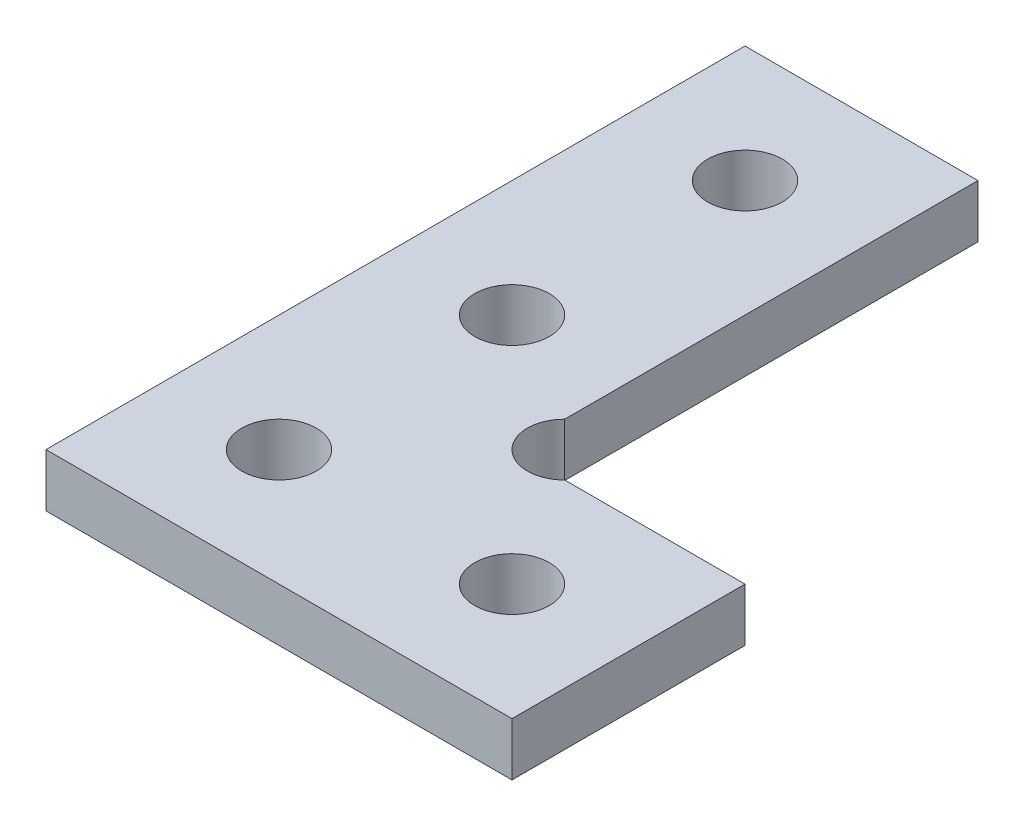
ISO-10303-21;
HEADER;
FILE_DESCRIPTION(('STEP AP214'),'2;1');
FILE_NAME('part.step','',(''),(''),'','','');
FILE_SCHEMA(('AUTOMOTIVE_DESIGN { 1 0 10303 214 1 1 1 1 }'));
ENDSEC;
DATA;
#1=APPLICATION_CONTEXT('core data for automotive mechanical design processes');
#2=APPLICATION_PROTOCOL_DEFINITION('international standard','automotive_design',2000,#1);
#3=PRODUCT_CONTEXT('',#1,'mechanical');
#4=PRODUCT('Part','Part','',(#3));
#5=PRODUCT_RELATED_PRODUCT_CATEGORY('part','',(#4));
#6=PRODUCT_DEFINITION_FORMATION('','',#4);
#7=PRODUCT_DEFINITION_CONTEXT('part definition',#1,'design');
#8=PRODUCT_DEFINITION('design','',#6,#7);
#9=PRODUCT_DEFINITION_SHAPE('','',#8);
#10=(LENGTH_UNIT() NAMED_UNIT(*) SI_UNIT(.MILLI.,.METRE.));
#11=(NAMED_UNIT(*) PLANE_ANGLE_UNIT() SI_UNIT($,.RADIAN.));
#12=(NAMED_UNIT(*) SI_UNIT($,.STERADIAN.) SOLID_ANGLE_UNIT());
#13=UNCERTAINTY_MEASURE_WITH_UNIT(LENGTH_MEASURE(1.E-05),#10,'distance_accuracy_value','');
#14=(GEOMETRIC_REPRESENTATION_CONTEXT(3) GLOBAL_UNCERTAINTY_ASSIGNED_CONTEXT((#13)) GLOBAL_UNIT_ASSIGNED_CONTEXT((#10,
#11,#12)) REPRESENTATION_CONTEXT('',''));
#15=CARTESIAN_POINT('',(0.,0.,0.));
#16=DIRECTION('',(0.,0.,1.));
#17=DIRECTION('',(1.,0.,0.));
#18=AXIS2_PLACEMENT_3D('',#15,#16,#17);
#19=CARTESIAN_POINT('',(10.,-1.13999999999986,-29.9999999999998));
#20=DIRECTION('',(0.,0.,-1.));
#21=DIRECTION('',(-1.,0.,0.));
#22=AXIS2_PLACEMENT_3D('',#19,#20,#21);
#23=PLANE('',#22);
#24=DIRECTION('',(-1.,0.,0.));
#25=VECTOR('',#24,1.);
#26=CARTESIAN_POINT('',(10.,1.14000000000014,-29.9999999999998));
#27=LINE('',#26,#25);
#28=CARTESIAN_POINT('',(10.,1.14000000000014,-29.9999999999998));
#29=VERTEX_POINT('',#28);
#30=CARTESIAN_POINT('',(0.,1.14000000000014,-29.9999999999998));
#31=VERTEX_POINT('',#30);
#32=EDGE_CURVE('E123',#29,#31,#27,.T.);
#33=ORIENTED_EDGE('',*,*,#32,.F.);
#34=DIRECTION('',(0.,1.,0.));
#35=VECTOR('',#34,1.);
#36=CARTESIAN_POINT('',(10.,-1.13999999999986,-29.9999999999998));
#37=LINE('',#36,#35);
#38=CARTESIAN_POINT('',(10.,-1.13999999999986,-29.9999999999998));
#39=VERTEX_POINT('',#38);
#40=EDGE_CURVE('E11',#39,#29,#37,.T.);
#41=ORIENTED_EDGE('',*,*,#40,.F.);
#42=DIRECTION('',(-1.,0.,0.));
#43=VECTOR('',#42,1.);
#44=CARTESIAN_POINT('',(10.,-1.13999999999986,-29.9999999999998));
#45=LINE('',#44,#43);
#46=CARTESIAN_POINT('',(0.,-1.13999999999986,-29.9999999999998));
#47=VERTEX_POINT('',#46);
#48=EDGE_CURVE('E141',#39,#47,#45,.T.);
#49=ORIENTED_EDGE('',*,*,#48,.T.);
#50=DIRECTION('',(0.,1.,0.));
#51=VECTOR('',#50,1.);
#52=CARTESIAN_POINT('',(0.,-1.13999999999986,-29.9999999999998));
#53=LINE('',#52,#51);
#54=EDGE_CURVE('E35',#47,#31,#53,.T.);
#55=ORIENTED_EDGE('',*,*,#54,.T.);
#56=EDGE_LOOP('',(#33,#41,#49,#55));
#57=FACE_BOUND('',#56,.T.);
#58=ADVANCED_FACE('F32',(#57),#23,.T.);
#59=CARTESIAN_POINT('',(10.,-1.13999999999986,-12.2627400407862));
#60=DIRECTION('',(1.,0.,0.));
#61=DIRECTION('',(0.,0.,-1.));
#62=AXIS2_PLACEMENT_3D('',#59,#60,#61);
#63=PLANE('',#62);
#64=DIRECTION('',(0.,0.,-1.));
#65=VECTOR('',#64,1.);
#66=CARTESIAN_POINT('',(10.,1.14000000000014,-12.2627400407862));
#67=LINE('',#66,#65);
#68=CARTESIAN_POINT('',(10.,1.14000000000014,-12.2627400407862));
#69=VERTEX_POINT('',#68);
#70=EDGE_CURVE('E139',#69,#29,#67,.T.);
#71=ORIENTED_EDGE('',*,*,#70,.F.);
#72=DIRECTION('',(0.,1.,0.));
#73=VECTOR('',#72,1.);
#74=CARTESIAN_POINT('',(10.,-1.13999999999986,-12.2627400407862));
#75=LINE('',#74,#73);
#76=CARTESIAN_POINT('',(10.,-1.13999999999986,-12.2627400407862));
#77=VERTEX_POINT('',#76);
#78=EDGE_CURVE('E41',#77,#69,#75,.T.);
#79=ORIENTED_EDGE('',*,*,#78,.F.);
#80=DIRECTION('',(0.,0.,-1.));
#81=VECTOR('',#80,1.);
#82=CARTESIAN_POINT('',(10.,-1.13999999999986,-12.2627400407862));
#83=LINE('',#82,#81);
#84=EDGE_CURVE('E113',#77,#39,#83,.T.);
#85=ORIENTED_EDGE('',*,*,#84,.T.);
#86=ORIENTED_EDGE('',*,*,#40,.T.);
#87=EDGE_LOOP('',(#71,#79,#85,#86));
#88=FACE_BOUND('',#87,.T.);
#89=ADVANCED_FACE('F151',(#88),#63,.T.);
#90=CARTESIAN_POINT('',(11.13,-1.13999999999986,-11.1300000000001));
#91=DIRECTION('',(0.,1.,0.));
#92=DIRECTION('',(0.,0.,1.));
#93=AXIS2_PLACEMENT_3D('',#90,#91,#92);
#94=CYLINDRICAL_SURFACE('',#93,1.60000000000002);
#95=CARTESIAN_POINT('',(11.13,1.14000000000014,-11.1300000000001));
#96=DIRECTION('',(0.,-1.,0.));
#97=DIRECTION('',(0.,0.,1.));
#98=AXIS2_PLACEMENT_3D('',#95,#96,#97);
#99=CIRCLE('',#98,1.60000000000002);
#100=CARTESIAN_POINT('',(12.2627400407862,1.14000000000014,-10.0000000000002));
#101=VERTEX_POINT('',#100);
#102=EDGE_CURVE('E100',#101,#69,#99,.T.);
#103=ORIENTED_EDGE('',*,*,#102,.F.);
#104=DIRECTION('',(0.,1.,0.));
#105=VECTOR('',#104,1.);
#106=CARTESIAN_POINT('',(12.2627400407862,-1.13999999999986,-10.0000000000002));
#107=LINE('',#106,#105);
#108=CARTESIAN_POINT('',(12.2627400407862,-1.13999999999986,-10.0000000000002));
#109=VERTEX_POINT('',#108);
#110=EDGE_CURVE('E95',#109,#101,#107,.T.);
#111=ORIENTED_EDGE('',*,*,#110,.F.);
#112=CARTESIAN_POINT('',(11.13,-1.13999999999986,-11.1300000000001));
#113=DIRECTION('',(0.,-1.,0.));
#114=DIRECTION('',(0.,0.,1.));
#115=AXIS2_PLACEMENT_3D('',#112,#113,#114);
#116=CIRCLE('',#115,1.60000000000002);
#117=EDGE_CURVE('E98',#109,#77,#116,.T.);
#118=ORIENTED_EDGE('',*,*,#117,.T.);
#119=ORIENTED_EDGE('',*,*,#78,.T.);
#120=EDGE_LOOP('',(#103,#111,#118,#119));
#121=FACE_BOUND('',#120,.T.);
#122=ADVANCED_FACE('F97',(#121),#94,.F.);
#123=CARTESIAN_POINT('',(20.,-1.13999999999986,-9.99999999999979));
#124=DIRECTION('',(0.,0.,-1.));
#125=DIRECTION('',(-1.,0.,0.));
#126=AXIS2_PLACEMENT_3D('',#123,#124,#125);
#127=PLANE('',#126);
#128=DIRECTION('',(-1.,0.,0.));
#129=VECTOR('',#128,1.);
#130=CARTESIAN_POINT('',(20.,1.14000000000014,-9.99999999999979));
#131=LINE('',#130,#129);
#132=CARTESIAN_POINT('',(20.,1.14000000000014,-9.99999999999979));
#133=VERTEX_POINT('',#132);
#134=EDGE_CURVE('E136',#133,#101,#131,.T.);
#135=ORIENTED_EDGE('',*,*,#134,.F.);
#136=DIRECTION('',(0.,1.,0.));
#137=VECTOR('',#136,1.);
#138=CARTESIAN_POINT('',(20.,-1.13999999999986,-9.99999999999979));
#139=LINE('',#138,#137);
#140=CARTESIAN_POINT('',(20.,-1.13999999999986,-9.99999999999979));
#141=VERTEX_POINT('',#140);
#142=EDGE_CURVE('E105',#141,#133,#139,.T.);
#143=ORIENTED_EDGE('',*,*,#142,.F.);
#144=DIRECTION('',(-1.,0.,0.));
#145=VECTOR('',#144,1.);
#146=CARTESIAN_POINT('',(20.,-1.13999999999986,-9.99999999999979));
#147=LINE('',#146,#145);
#148=EDGE_CURVE('E111',#141,#109,#147,.T.);
#149=ORIENTED_EDGE('',*,*,#148,.T.);
#150=ORIENTED_EDGE('',*,*,#110,.T.);
#151=EDGE_LOOP('',(#135,#143,#149,#150));
#152=FACE_BOUND('',#151,.T.);
#153=ADVANCED_FACE('F115',(#152),#127,.T.);
#154=CARTESIAN_POINT('',(20.,-1.13999999999986,0.));
#155=DIRECTION('',(1.,0.,0.));
#156=DIRECTION('',(0.,0.,-1.));
#157=AXIS2_PLACEMENT_3D('',#154,#155,#156);
#158=PLANE('',#157);
#159=DIRECTION('',(0.,0.,-1.));
#160=VECTOR('',#159,1.);
#161=CARTESIAN_POINT('',(20.,1.14000000000014,0.));
#162=LINE('',#161,#160);
#163=CARTESIAN_POINT('',(20.,1.14000000000014,0.));
#164=VERTEX_POINT('',#163);
#165=EDGE_CURVE('E133',#164,#133,#162,.T.);
#166=ORIENTED_EDGE('',*,*,#165,.F.);
#167=DIRECTION('',(0.,1.,0.));
#168=VECTOR('',#167,1.);
#169=CARTESIAN_POINT('',(20.,-1.13999999999986,0.));
#170=LINE('',#169,#168);
#171=CARTESIAN_POINT('',(20.,-1.13999999999986,0.));
#172=VERTEX_POINT('',#171);
#173=EDGE_CURVE('E145',#172,#164,#170,.T.);
#174=ORIENTED_EDGE('',*,*,#173,.F.);
#175=DIRECTION('',(0.,0.,-1.));
#176=VECTOR('',#175,1.);
#177=CARTESIAN_POINT('',(20.,-1.13999999999986,0.));
#178=LINE('',#177,#176);
#179=EDGE_CURVE('E116',#172,#141,#178,.T.);
#180=ORIENTED_EDGE('',*,*,#179,.T.);
#181=ORIENTED_EDGE('',*,*,#142,.T.);
#182=EDGE_LOOP('',(#166,#174,#180,#181));
#183=FACE_BOUND('',#182,.T.);
#184=ADVANCED_FACE('F164',(#183),#158,.T.);
#185=CARTESIAN_POINT('',(0.,-1.13999999999986,0.));
#186=DIRECTION('',(0.,0.,1.));
#187=DIRECTION('',(1.,0.,0.));
#188=AXIS2_PLACEMENT_3D('',#185,#186,#187);
#189=PLANE('',#188);
#190=DIRECTION('',(1.,0.,0.));
#191=VECTOR('',#190,1.);
#192=CARTESIAN_POINT('',(0.,1.14000000000014,0.));
#193=LINE('',#192,#191);
#194=CARTESIAN_POINT('',(0.,1.14000000000014,0.));
#195=VERTEX_POINT('',#194);
#196=EDGE_CURVE('E130',#195,#164,#193,.T.);
#197=ORIENTED_EDGE('',*,*,#196,.F.);
#198=DIRECTION('',(0.,1.,0.));
#199=VECTOR('',#198,1.);
#200=CARTESIAN_POINT('',(0.,-1.13999999999986,0.));
#201=LINE('',#200,#199);
#202=CARTESIAN_POINT('',(0.,-1.13999999999986,0.));
#203=VERTEX_POINT('',#202);
#204=EDGE_CURVE('E146',#203,#195,#201,.T.);
#205=ORIENTED_EDGE('',*,*,#204,.F.);
#206=DIRECTION('',(1.,0.,0.));
#207=VECTOR('',#206,1.);
#208=CARTESIAN_POINT('',(0.,-1.13999999999986,0.));
#209=LINE('',#208,#207);
#210=EDGE_CURVE('E118',#203,#172,#209,.T.);
#211=ORIENTED_EDGE('',*,*,#210,.T.);
#212=ORIENTED_EDGE('',*,*,#173,.T.);
#213=EDGE_LOOP('',(#197,#205,#211,#212));
#214=FACE_BOUND('',#213,.T.);
#215=ADVANCED_FACE('F167',(#214),#189,.T.);
#216=CARTESIAN_POINT('',(0.,-1.13999999999986,-29.9999999999998));
#217=DIRECTION('',(-1.,0.,0.));
#218=DIRECTION('',(0.,0.,1.));
#219=AXIS2_PLACEMENT_3D('',#216,#217,#218);
#220=PLANE('',#219);
#221=DIRECTION('',(0.,0.,1.));
#222=VECTOR('',#221,1.);
#223=CARTESIAN_POINT('',(0.,1.14000000000014,-29.9999999999998));
#224=LINE('',#223,#222);
#225=EDGE_CURVE('E126',#31,#195,#224,.T.);
#226=ORIENTED_EDGE('',*,*,#225,.F.);
#227=ORIENTED_EDGE('',*,*,#54,.F.);
#228=DIRECTION('',(0.,0.,1.));
#229=VECTOR('',#228,1.);
#230=CARTESIAN_POINT('',(0.,-1.13999999999986,-29.9999999999998));
#231=LINE('',#230,#229);
#232=EDGE_CURVE('E227',#47,#203,#231,.T.);
#233=ORIENTED_EDGE('',*,*,#232,.T.);
#234=ORIENTED_EDGE('',*,*,#204,.T.);
#235=EDGE_LOOP('',(#226,#227,#233,#234));
#236=FACE_BOUND('',#235,.T.);
#237=ADVANCED_FACE('F148',(#236),#220,.T.);
#238=CARTESIAN_POINT('',(11.13,-1.13999999999986,-11.1300000000001));
#239=DIRECTION('',(0.,1.,0.));
#240=DIRECTION('',(0.,0.,1.));
#241=AXIS2_PLACEMENT_3D('',#238,#239,#240);
#242=PLANE('',#241);
#243=CARTESIAN_POINT('',(5.,-1.13999999999986,-24.9999999999999));
#244=DIRECTION('',(0.,1.,0.));
#245=DIRECTION('',(0.,0.,1.));
#246=AXIS2_PLACEMENT_3D('',#243,#244,#245);
#247=CIRCLE('',#246,1.59999999999999);
#248=CARTESIAN_POINT('',(5.,-1.13999999999986,-23.3999999999999));
#249=VERTEX_POINT('',#248);
#250=EDGE_CURVE('E205',#249,#249,#247,.T.);
#251=ORIENTED_EDGE('',*,*,#250,.T.);
#252=EDGE_LOOP('',(#251));
#253=FACE_BOUND('',#252,.T.);
#254=CARTESIAN_POINT('',(5.,-1.13999999999986,-4.99999999999989));
#255=DIRECTION('',(0.,1.,0.));
#256=DIRECTION('',(0.,0.,1.));
#257=AXIS2_PLACEMENT_3D('',#254,#255,#256);
#258=CIRCLE('',#257,1.59999999999999);
#259=CARTESIAN_POINT('',(5.,-1.13999999999986,-3.39999999999991));
#260=VERTEX_POINT('',#259);
#261=EDGE_CURVE('E209',#260,#260,#258,.T.);
#262=ORIENTED_EDGE('',*,*,#261,.T.);
#263=EDGE_LOOP('',(#262));
#264=FACE_BOUND('',#263,.T.);
#265=CARTESIAN_POINT('',(15.,-1.13999999999986,-4.99999999999989));
#266=DIRECTION('',(0.,1.,0.));
#267=DIRECTION('',(0.,0.,1.));
#268=AXIS2_PLACEMENT_3D('',#265,#266,#267);
#269=CIRCLE('',#268,1.59999999999999);
#270=CARTESIAN_POINT('',(15.,-1.13999999999986,-3.39999999999991));
#271=VERTEX_POINT('',#270);
#272=EDGE_CURVE('E218',#271,#271,#269,.T.);
#273=ORIENTED_EDGE('',*,*,#272,.T.);
#274=EDGE_LOOP('',(#273));
#275=FACE_BOUND('',#274,.T.);
#276=CARTESIAN_POINT('',(5.,-1.13999999999986,-14.9999999999997));
#277=DIRECTION('',(0.,1.,0.));
#278=DIRECTION('',(0.,0.,1.));
#279=AXIS2_PLACEMENT_3D('',#276,#277,#278);
#280=CIRCLE('',#279,1.59999999999999);
#281=CARTESIAN_POINT('',(5.,-1.13999999999986,-13.3999999999997));
#282=VERTEX_POINT('',#281);
#283=EDGE_CURVE('E127',#282,#282,#280,.T.);
#284=ORIENTED_EDGE('',*,*,#283,.T.);
#285=EDGE_LOOP('',(#284));
#286=FACE_BOUND('',#285,.T.);
#287=ORIENTED_EDGE('',*,*,#48,.F.);
#288=ORIENTED_EDGE('',*,*,#84,.F.);
#289=ORIENTED_EDGE('',*,*,#117,.F.);
#290=ORIENTED_EDGE('',*,*,#148,.F.);
#291=ORIENTED_EDGE('',*,*,#179,.F.);
#292=ORIENTED_EDGE('',*,*,#210,.F.);
#293=ORIENTED_EDGE('',*,*,#232,.F.);
#294=EDGE_LOOP('',(#287,#288,#289,#290,#291,#292,#293));
#295=FACE_BOUND('',#294,.T.);
#296=ADVANCED_FACE('F109',(#253,#264,#275,#286,#295),#242,.F.);
#297=CARTESIAN_POINT('',(11.13,1.14000000000014,-11.1300000000001));
#298=DIRECTION('',(0.,1.,0.));
#299=DIRECTION('',(0.,0.,1.));
#300=AXIS2_PLACEMENT_3D('',#297,#298,#299);
#301=PLANE('',#300);
#302=CARTESIAN_POINT('',(5.,1.14000000000014,-24.9999999999999));
#303=DIRECTION('',(0.,1.,0.));
#304=DIRECTION('',(0.,0.,1.));
#305=AXIS2_PLACEMENT_3D('',#302,#303,#304);
#306=CIRCLE('',#305,1.59999999999999);
#307=CARTESIAN_POINT('',(5.,1.14000000000014,-23.3999999999999));
#308=VERTEX_POINT('',#307);
#309=EDGE_CURVE('E203',#308,#308,#306,.T.);
#310=ORIENTED_EDGE('',*,*,#309,.F.);
#311=EDGE_LOOP('',(#310));
#312=FACE_BOUND('',#311,.T.);
#313=CARTESIAN_POINT('',(5.,1.14000000000014,-4.99999999999989));
#314=DIRECTION('',(0.,1.,0.));
#315=DIRECTION('',(0.,0.,1.));
#316=AXIS2_PLACEMENT_3D('',#313,#314,#315);
#317=CIRCLE('',#316,1.59999999999999);
#318=CARTESIAN_POINT('',(5.,1.14000000000014,-3.3999999999999));
#319=VERTEX_POINT('',#318);
#320=EDGE_CURVE('E206',#319,#319,#317,.T.);
#321=ORIENTED_EDGE('',*,*,#320,.F.);
#322=EDGE_LOOP('',(#321));
#323=FACE_BOUND('',#322,.T.);
#324=CARTESIAN_POINT('',(15.,1.14000000000014,-4.99999999999989));
#325=DIRECTION('',(0.,1.,0.));
#326=DIRECTION('',(0.,0.,1.));
#327=AXIS2_PLACEMENT_3D('',#324,#325,#326);
#328=CIRCLE('',#327,1.59999999999999);
#329=CARTESIAN_POINT('',(15.,1.14000000000014,-3.39999999999991));
#330=VERTEX_POINT('',#329);
#331=EDGE_CURVE('E215',#330,#330,#328,.T.);
#332=ORIENTED_EDGE('',*,*,#331,.F.);
#333=EDGE_LOOP('',(#332));
#334=FACE_BOUND('',#333,.T.);
#335=CARTESIAN_POINT('',(5.,1.14000000000014,-14.9999999999997));
#336=DIRECTION('',(0.,1.,0.));
#337=DIRECTION('',(0.,0.,1.));
#338=AXIS2_PLACEMENT_3D('',#335,#336,#337);
#339=CIRCLE('',#338,1.59999999999999);
#340=CARTESIAN_POINT('',(5.,1.14000000000014,-13.3999999999997));
#341=VERTEX_POINT('',#340);
#342=EDGE_CURVE('E221',#341,#341,#339,.T.);
#343=ORIENTED_EDGE('',*,*,#342,.F.);
#344=EDGE_LOOP('',(#343));
#345=FACE_BOUND('',#344,.T.);
#346=ORIENTED_EDGE('',*,*,#32,.T.);
#347=ORIENTED_EDGE('',*,*,#225,.T.);
#348=ORIENTED_EDGE('',*,*,#196,.T.);
#349=ORIENTED_EDGE('',*,*,#165,.T.);
#350=ORIENTED_EDGE('',*,*,#134,.T.);
#351=ORIENTED_EDGE('',*,*,#102,.T.);
#352=ORIENTED_EDGE('',*,*,#70,.T.);
#353=EDGE_LOOP('',(#346,#347,#348,#349,#350,#351,#352));
#354=FACE_BOUND('',#353,.T.);
#355=ADVANCED_FACE('F150',(#312,#323,#334,#345,#354),#301,.T.);
#356=CARTESIAN_POINT('',(5.,1.14000000000014,-14.9999999999997));
#357=DIRECTION('',(0.,1.,0.));
#358=DIRECTION('',(0.,0.,1.));
#359=AXIS2_PLACEMENT_3D('',#356,#357,#358);
#360=CYLINDRICAL_SURFACE('',#359,1.59999999999999);
#361=ORIENTED_EDGE('',*,*,#342,.T.);
#362=EDGE_LOOP('',(#361));
#363=FACE_BOUND('',#362,.T.);
#364=ORIENTED_EDGE('',*,*,#283,.F.);
#365=EDGE_LOOP('',(#364));
#366=FACE_BOUND('',#365,.T.);
#367=ADVANCED_FACE('F179',(#363,#366),#360,.F.);
#368=CARTESIAN_POINT('',(15.,1.14000000000014,-4.99999999999989));
#369=DIRECTION('',(0.,1.,0.));
#370=DIRECTION('',(0.,0.,1.));
#371=AXIS2_PLACEMENT_3D('',#368,#369,#370);
#372=CYLINDRICAL_SURFACE('',#371,1.59999999999999);
#373=ORIENTED_EDGE('',*,*,#331,.T.);
#374=EDGE_LOOP('',(#373));
#375=FACE_BOUND('',#374,.T.);
#376=ORIENTED_EDGE('',*,*,#272,.F.);
#377=EDGE_LOOP('',(#376));
#378=FACE_BOUND('',#377,.T.);
#379=ADVANCED_FACE('F186',(#375,#378),#372,.F.);
#380=CARTESIAN_POINT('',(5.,1.14000000000014,-4.99999999999989));
#381=DIRECTION('',(0.,1.,0.));
#382=DIRECTION('',(0.,0.,1.));
#383=AXIS2_PLACEMENT_3D('',#380,#381,#382);
#384=CYLINDRICAL_SURFACE('',#383,1.59999999999999);
#385=ORIENTED_EDGE('',*,*,#320,.T.);
#386=EDGE_LOOP('',(#385));
#387=FACE_BOUND('',#386,.T.);
#388=ORIENTED_EDGE('',*,*,#261,.F.);
#389=EDGE_LOOP('',(#388));
#390=FACE_BOUND('',#389,.T.);
#391=ADVANCED_FACE('F190',(#387,#390),#384,.F.);
#392=CARTESIAN_POINT('',(5.,1.14000000000014,-24.9999999999999));
#393=DIRECTION('',(0.,1.,0.));
#394=DIRECTION('',(0.,0.,1.));
#395=AXIS2_PLACEMENT_3D('',#392,#393,#394);
#396=CYLINDRICAL_SURFACE('',#395,1.59999999999999);
#397=ORIENTED_EDGE('',*,*,#309,.T.);
#398=EDGE_LOOP('',(#397));
#399=FACE_BOUND('',#398,.T.);
#400=ORIENTED_EDGE('',*,*,#250,.F.);
#401=EDGE_LOOP('',(#400));
#402=FACE_BOUND('',#401,.T.);
#403=ADVANCED_FACE('F194',(#399,#402),#396,.F.);
#404=CLOSED_SHELL('',(#58,#89,#122,#153,#184,#215,#237,#296,#355,#367,#379,#391,#403));
#405=MANIFOLD_SOLID_BREP('B2',#404);
#406=ADVANCED_BREP_SHAPE_REPRESENTATION('',(#18,#405),#14);
#407=SHAPE_DEFINITION_REPRESENTATION(#9,#406);
ENDSEC;
END-ISO-10303-21;
